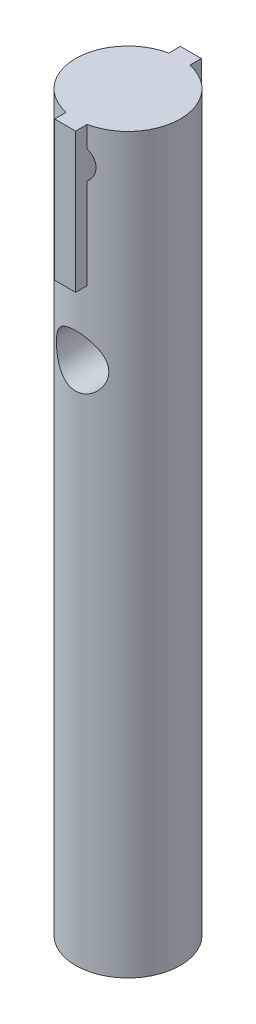
ISO-10303-21;
HEADER;
FILE_DESCRIPTION(('STEP AP214'),'2;1');
FILE_NAME('part.step','',(''),(''),'','','');
FILE_SCHEMA(('AUTOMOTIVE_DESIGN { 1 0 10303 214 1 1 1 1 }'));
ENDSEC;
DATA;
#1=APPLICATION_CONTEXT('core data for automotive mechanical design processes');
#2=APPLICATION_PROTOCOL_DEFINITION('international standard','automotive_design',2000,#1);
#3=PRODUCT_CONTEXT('',#1,'mechanical');
#4=PRODUCT('Part','Part','',(#3));
#5=PRODUCT_RELATED_PRODUCT_CATEGORY('part','',(#4));
#6=PRODUCT_DEFINITION_FORMATION('','',#4);
#7=PRODUCT_DEFINITION_CONTEXT('part definition',#1,'design');
#8=PRODUCT_DEFINITION('design','',#6,#7);
#9=PRODUCT_DEFINITION_SHAPE('','',#8);
#10=(LENGTH_UNIT() NAMED_UNIT(*) SI_UNIT(.MILLI.,.METRE.));
#11=(NAMED_UNIT(*) PLANE_ANGLE_UNIT() SI_UNIT($,.RADIAN.));
#12=(NAMED_UNIT(*) SI_UNIT($,.STERADIAN.) SOLID_ANGLE_UNIT());
#13=UNCERTAINTY_MEASURE_WITH_UNIT(LENGTH_MEASURE(1.E-05),#10,'distance_accuracy_value','');
#14=(GEOMETRIC_REPRESENTATION_CONTEXT(3) GLOBAL_UNCERTAINTY_ASSIGNED_CONTEXT((#13)) GLOBAL_UNIT_ASSIGNED_CONTEXT((#10,
#11,#12)) REPRESENTATION_CONTEXT('',''));
#15=CARTESIAN_POINT('',(0.,0.,0.));
#16=DIRECTION('',(0.,0.,1.));
#17=DIRECTION('',(1.,0.,0.));
#18=AXIS2_PLACEMENT_3D('',#15,#16,#17);
#19=CARTESIAN_POINT('',(0.,100.,10.));
#20=DIRECTION('',(0.,0.,-1.));
#21=DIRECTION('',(-1.,0.,0.));
#22=AXIS2_PLACEMENT_3D('',#19,#20,#21);
#23=CYLINDRICAL_SURFACE('',#22,2.5);
#24=DIRECTION('',(0.,0.,-1.));
#25=VECTOR('',#24,1.);
#26=CARTESIAN_POINT('',(1.5,98.,10.));
#27=LINE('',#26,#25);
#28=CARTESIAN_POINT('',(1.5,98.,7.34846922834953));
#29=VERTEX_POINT('',#28);
#30=CARTESIAN_POINT('',(1.5,98.,-7.34846922834953));
#31=VERTEX_POINT('',#30);
#32=EDGE_CURVE('E275',#29,#31,#27,.T.);
#33=ORIENTED_EDGE('',*,*,#32,.F.);
#34=CARTESIAN_POINT('',(-2.49999999999995,100.,7.07106781186549));
#35=CARTESIAN_POINT('',(-2.50000064486923,99.8638295629098,7.07106736326087));
#36=CARTESIAN_POINT('',(-2.48883695921375,99.727663000441,7.07504423227145));
#37=CARTESIAN_POINT('',(-2.44462782922197,99.4593639475144,7.09043935203139));
#38=CARTESIAN_POINT('',(-2.41157878042094,99.3272321253188,7.10185882855474));
#39=CARTESIAN_POINT('',(-2.32488871421221,99.0709327675068,7.13070509221981));
#40=CARTESIAN_POINT('',(-2.27128805350806,98.9467501763932,7.14812009928306));
#41=CARTESIAN_POINT('',(-2.1451540711034,98.7090998786301,7.18697805025813));
#42=CARTESIAN_POINT('',(-2.07261657215041,98.5956345436159,7.20842188259032));
#43=CARTESIAN_POINT('',(-1.90762786610715,98.3782000941542,7.25386223518684));
#44=CARTESIAN_POINT('',(-1.81456085344476,98.2747114283207,7.27792237111611));
#45=CARTESIAN_POINT('',(-1.61246916803594,98.0844829969384,7.32534662002508));
#46=CARTESIAN_POINT('',(-1.50344193763089,97.9977459210441,7.34871062072405));
#47=CARTESIAN_POINT('',(-1.26901126991247,97.841302756676,7.39284667304498));
#48=CARTESIAN_POINT('',(-1.14325477806126,97.7721000734551,7.41353519254015));
#49=CARTESIAN_POINT('',(-0.881078057468629,97.6560210371812,7.44923966927458));
#50=CARTESIAN_POINT('',(-0.744660714217974,97.6091386670577,7.46425715507505));
#51=CARTESIAN_POINT('',(-0.47007204358368,97.540660363419,7.48647688579767));
#52=CARTESIAN_POINT('',(-0.332126887132365,97.5182413843575,7.49393286943898));
#53=CARTESIAN_POINT('',(-0.0542446870601675,97.4967092665983,7.5010902054562));
#54=CARTESIAN_POINT('',(0.0856918338597973,97.497590120869,7.50079355657239));
#55=CARTESIAN_POINT('',(0.357758787984593,97.5221106364151,7.49265099046828));
#56=CARTESIAN_POINT('',(0.489980121479198,97.5448563211862,7.48510161887793));
#57=CARTESIAN_POINT('',(0.748608597055486,97.6109824524512,7.46367418349328));
#58=CARTESIAN_POINT('',(0.875015344448096,97.6543642974496,7.44979569077954));
#59=CARTESIAN_POINT('',(1.12038118710499,97.7610532932651,7.4168917573306));
#60=CARTESIAN_POINT('',(1.23922055242217,97.8246148463663,7.39780106310038));
#61=CARTESIAN_POINT('',(1.46481081381836,97.9696492636216,7.35645982597296));
#62=CARTESIAN_POINT('',(1.57155833596341,98.0511271083191,7.33420840503666));
#63=CARTESIAN_POINT('',(1.77525216637833,98.2341859836492,7.2876547962474));
#64=CARTESIAN_POINT('',(1.87150039266324,98.3365328946037,7.26330537922193));
#65=CARTESIAN_POINT('',(2.04569314899549,98.5561218143166,7.2161833812225));
#66=CARTESIAN_POINT('',(2.12363485820392,98.6733661143201,7.19341104364037));
#67=CARTESIAN_POINT('',(2.25996863758942,98.9216340640086,7.15176312802779));
#68=CARTESIAN_POINT('',(2.31806615905341,99.0528303282944,7.13294773211868));
#69=CARTESIAN_POINT('',(2.4111079831734,99.323928485536,7.1020412706096));
#70=CARTESIAN_POINT('',(2.4460619893688,99.4638267030156,7.08994738717729));
#71=CARTESIAN_POINT('',(2.49040320524387,99.7415958885289,7.0744909078896));
#72=CARTESIAN_POINT('',(2.50087273876914,99.8792735618717,7.07075900796888));
#73=CARTESIAN_POINT('',(2.49901359727436,100.154440372785,7.07141680147959));
#74=CARTESIAN_POINT('',(2.48668906306697,100.29192954006,7.07580501979534));
#75=CARTESIAN_POINT('',(2.44056412888084,100.55789241428,7.09184045225746));
#76=CARTESIAN_POINT('',(2.40751598495177,100.686513575377,7.10323313602099));
#77=CARTESIAN_POINT('',(2.32178465640123,100.936359015598,7.13171384177555));
#78=CARTESIAN_POINT('',(2.26909799090862,101.057581978977,7.14880287337097));
#79=CARTESIAN_POINT('',(2.14368585184741,101.293451052118,7.18742193989465));
#80=CARTESIAN_POINT('',(2.07037779589631,101.407766606604,7.20907564164069));
#81=CARTESIAN_POINT('',(1.90646407639397,101.622865130959,7.25414421827411));
#82=CARTESIAN_POINT('',(1.81585331374702,101.723644096653,7.27755961109484));
#83=CARTESIAN_POINT('',(1.61472926475088,101.913819960227,7.32487596594621));
#84=CARTESIAN_POINT('',(1.5034681763667,102.002435975047,7.3487460894474));
#85=CARTESIAN_POINT('',(1.26706822850072,102.15979035587,7.3931712903277));
#86=CARTESIAN_POINT('',(1.14192986216145,102.228529427906,7.41372648544236));
#87=CARTESIAN_POINT('',(0.881949656080811,102.343550262154,7.44911014526507));
#88=CARTESIAN_POINT('',(0.747177808303062,102.38997819287,7.46397575011327));
#89=CARTESIAN_POINT('',(0.471146164615108,102.45931935515,7.48646527094436));
#90=CARTESIAN_POINT('',(0.329888729884788,102.482241074701,7.49409180085047));
#91=CARTESIAN_POINT('',(0.0520383396501632,102.503155194014,7.50104658090641));
#92=CARTESIAN_POINT('',(-0.0844618097999865,102.502268634831,7.50074800223598));
#93=CARTESIAN_POINT('',(-0.355277862500375,102.478356729634,7.49280491298495));
#94=CARTESIAN_POINT('',(-0.489593942047582,102.455333179618,7.4851609983394));
#95=CARTESIAN_POINT('',(-0.750105298580088,102.38854441356,7.46352287386031));
#96=CARTESIAN_POINT('',(-0.876395677281915,102.345114461618,7.44963145902872));
#97=CARTESIAN_POINT('',(-1.11994587734943,102.239056172257,7.41692901761238));
#98=CARTESIAN_POINT('',(-1.23720406035602,102.176424362007,7.39811710120042));
#99=CARTESIAN_POINT('',(-1.4640850407719,102.031076219745,7.35664672069703));
#100=CARTESIAN_POINT('',(-1.57326562889396,101.947703286546,7.33387181229818));
#101=CARTESIAN_POINT('',(-1.77645256568101,101.76435652211,7.287324719797));
#102=CARTESIAN_POINT('',(-1.87045405406142,101.664377394343,7.26355221932744));
#103=CARTESIAN_POINT('',(-2.04435452208274,101.445976611033,7.21658199563997));
#104=CARTESIAN_POINT('',(-2.1235574149947,101.326986222558,7.19344319971578));
#105=CARTESIAN_POINT('',(-2.26078585825274,101.076663932743,7.1515048330754));
#106=CARTESIAN_POINT('',(-2.31881694204863,100.945335267426,7.13270412903125));
#107=CARTESIAN_POINT('',(-2.40960957051036,100.680095439961,7.10253335516288));
#108=CARTESIAN_POINT('',(-2.44339477287375,100.546569341187,7.09086582142957));
#109=CARTESIAN_POINT('',(-2.48858580037311,100.275359873833,7.07513458848798));
#110=CARTESIAN_POINT('',(-2.49999934799143,100.137677956473,7.07106826543655));
#111=CARTESIAN_POINT('',(-2.49999999999995,100.,7.07106781186549));
#112=B_SPLINE_CURVE_WITH_KNOTS('',3,(#34,#35,#36,#37,#38,#39,#40,#41,#42,#43,#44,#45,#46,#47,
#48,#49,#50,#51,#52,#53,#54,#55,#56,#57,#58,#59,#60,#61,#62,#63,#64,#65,#66,#67,#68,#69,#70,#71,
#72,#73,#74,#75,#76,#77,#78,#79,#80,#81,#82,#83,#84,#85,#86,#87,#88,#89,#90,#91,#92,#93,#94,#95,
#96,#97,#98,#99,#100,#101,#102,#103,#104,#105,#106,#107,#108,#109,#110,#111),.UNSPECIFIED.,.T.,
.F.,(4,2,2,2,2,2,2,2,2,2,2,2,2,2,2,2,2,2,2,2,2,2,2,2,2,2,2,2,2,2,2,2,2,2,2,2,2,2,4),(0.,
0.408001461998376,0.816070137537907,1.22334156875208,1.63070291546359,2.05253343568919,
2.4744316292997,2.90733765359143,3.34012690966973,3.75785796912336,4.17548133255819,
4.57672512063923,4.97799610473092,5.38454137150838,5.79119979685056,6.21700435909794,
6.64287449030267,7.07481599607639,7.5065762839154,7.91885728411102,8.33106339593085,
8.72910989421941,9.12722697867365,9.53797144339286,9.94883714155318,10.3794702042773,
10.8100879689383,11.2378447797713,11.6654470751039,12.0729521169409,12.4804241002445,
12.8814239010108,13.2824962690811,13.6983879880158,14.1144126108158,14.5467225684036,
14.9789194566717,15.3915803040673,15.8040986797616),.UNSPECIFIED.);
#113=CARTESIAN_POINT('',(1.5,102.,7.34846922834953));
#114=VERTEX_POINT('',#113);
#115=EDGE_CURVE('E256',#29,#114,#112,.T.);
#116=ORIENTED_EDGE('',*,*,#115,.T.);
#117=DIRECTION('',(0.,0.,-1.));
#118=VECTOR('',#117,1.);
#119=CARTESIAN_POINT('',(1.5,102.,10.));
#120=LINE('',#119,#118);
#121=CARTESIAN_POINT('',(1.5,102.,-7.34846922834953));
#122=VERTEX_POINT('',#121);
#123=EDGE_CURVE('E250',#122,#114,#120,.F.);
#124=ORIENTED_EDGE('',*,*,#123,.F.);
#125=CARTESIAN_POINT('',(0.,102.5,-7.5));
#126=CARTESIAN_POINT('',(0.136408407216808,102.500000634329,-7.5000003825236));
#127=CARTESIAN_POINT('',(0.272812986346375,102.488799334682,-7.49624423768862));
#128=CARTESIAN_POINT('',(0.541604402182432,102.444427227957,-7.48163025508202));
#129=CARTESIAN_POINT('',(0.673990820297047,102.411254140128,-7.47077168005381));
#130=CARTESIAN_POINT('',(0.930831973754444,102.32420189154,-7.44313269766106));
#131=CARTESIAN_POINT('',(1.05529956471509,102.270357343852,-7.42636219327133));
#132=CARTESIAN_POINT('',(1.29343734201332,102.143647067904,-7.38861114293354));
#133=CARTESIAN_POINT('',(1.40710539239677,102.070777587494,-7.36762976669445));
#134=CARTESIAN_POINT('',(1.62435418755568,101.905435487853,-7.32285236107512));
#135=CARTESIAN_POINT('',(1.72750925074579,101.812421914349,-7.29898891159462));
#136=CARTESIAN_POINT('',(1.91708173175523,101.610582113234,-7.25150786957803));
#137=CARTESIAN_POINT('',(2.00349546372368,101.501752412679,-7.22789033226372));
#138=CARTESIAN_POINT('',(2.15956235556968,101.267537212009,-7.18283331193183));
#139=CARTESIAN_POINT('',(2.22866214555262,101.14176565067,-7.16147598189219));
#140=CARTESIAN_POINT('',(2.34454718469434,100.879559763854,-7.12438263546501));
#141=CARTESIAN_POINT('',(2.39133924346695,100.743128707093,-7.10864490401863));
#142=CARTESIAN_POINT('',(2.45968365377296,100.468316946258,-7.08528258173441));
#143=CARTESIAN_POINT('',(2.48203362067947,100.330156978777,-7.07740239424026));
#144=CARTESIAN_POINT('',(2.50335280833625,100.05184061461,-7.06989141573767));
#145=CARTESIAN_POINT('',(2.50232925401186,99.9116848482271,-7.07025807556823));
#146=CARTESIAN_POINT('',(2.47754975925862,99.64015842389,-7.07897537520448));
#147=CARTESIAN_POINT('',(2.45483478291756,99.5086789927025,-7.0869603966883));
#148=CARTESIAN_POINT('',(2.38901540712362,99.251516450983,-7.10941644311375));
#149=CARTESIAN_POINT('',(2.34590856647976,99.1258340364124,-7.12388824460266));
#150=CARTESIAN_POINT('',(2.23984764515062,98.8814681260214,-7.15794777828119));
#151=CARTESIAN_POINT('',(2.17658512176825,98.7629299363262,-7.1776141448279));
#152=CARTESIAN_POINT('',(2.03222276575795,98.5378227293007,-7.21981396439313));
#153=CARTESIAN_POINT('',(1.95111778091011,98.4312571826666,-7.24234824476156));
#154=CARTESIAN_POINT('',(1.7683733317057,98.2272710045981,-7.2891832291935));
#155=CARTESIAN_POINT('',(1.66588287519089,98.1306182637274,-7.31351473387105));
#156=CARTESIAN_POINT('',(1.44584892492527,97.9556718333415,-7.3601734596759));
#157=CARTESIAN_POINT('',(1.32830398915215,97.8773799045888,-7.38250048845166));
#158=CARTESIAN_POINT('',(1.07986903261578,97.7407592494124,-7.42292769844482));
#159=CARTESIAN_POINT('',(0.948858191040957,97.6826362716482,-7.44098375020097));
#160=CARTESIAN_POINT('',(0.678172708411392,97.5894920651107,-7.47051417861086));
#161=CARTESIAN_POINT('',(0.538501095387512,97.5544628114414,-7.48199084137197));
#162=CARTESIAN_POINT('',(0.260959573823391,97.5098608349441,-7.49669067678601));
#163=CARTESIAN_POINT('',(0.123273999662244,97.4992504770681,-7.5002500458432));
#164=CARTESIAN_POINT('',(-0.15193767490047,97.5008316839962,-7.49972256737069));
#165=CARTESIAN_POINT('',(-0.289463798299006,97.5130193999497,-7.49563701048406));
#166=CARTESIAN_POINT('',(-0.556299665760522,97.5590297693399,-7.48050061792762));
#167=CARTESIAN_POINT('',(-0.685732017086993,97.5922155151237,-7.46965496777982));
#168=CARTESIAN_POINT('',(-0.93713989644882,97.6784836111668,-7.44229617075176));
#169=CARTESIAN_POINT('',(-1.0591144712714,97.7315684986694,-7.42578230116689));
#170=CARTESIAN_POINT('',(-1.29572074098308,97.8576760796019,-7.38822328218226));
#171=CARTESIAN_POINT('',(-1.41007489804276,97.9311864832079,-7.36707036889467));
#172=CARTESIAN_POINT('',(-1.62516207533887,98.0954853750337,-7.32263134790658));
#173=CARTESIAN_POINT('',(-1.72589091948884,98.1862791400794,-7.29934458984571));
#174=CARTESIAN_POINT('',(-1.91563126951566,98.3874468775164,-7.25192119951114));
#175=CARTESIAN_POINT('',(-2.00390242311434,98.4985230673171,-7.22779402718572));
#176=CARTESIAN_POINT('',(-2.16064380580885,98.7344289195272,-7.18249933236774));
#177=CARTESIAN_POINT('',(-2.22911386982745,98.8592586965851,-7.16133183455008));
#178=CARTESIAN_POINT('',(-2.34399232604083,99.1191825382247,-7.12455979478461));
#179=CARTESIAN_POINT('',(-2.39044533041248,99.2542551979219,-7.10894401982449));
#180=CARTESIAN_POINT('',(-2.45973666689832,99.5309466251103,-7.08527080766126));
#181=CARTESIAN_POINT('',(-2.48258563738479,99.6725624135108,-7.077209965591));
#182=CARTESIAN_POINT('',(-2.5031907061933,99.9504927401022,-7.06994647185445));
#183=CARTESIAN_POINT('',(-2.50217564327095,100.086705850717,-7.07031000643539));
#184=CARTESIAN_POINT('',(-2.47810573362168,100.356912687305,-7.0787817455967));
#185=CARTESIAN_POINT('',(-2.45505219864642,100.490906544888,-7.08688948923406));
#186=CARTESIAN_POINT('',(-2.38842953282333,100.750339157506,-7.1096131076223));
#187=CARTESIAN_POINT('',(-2.34525836503875,100.875892062511,-7.12410245056195));
#188=CARTESIAN_POINT('',(-2.23994841439934,101.118068517346,-7.15790997046172));
#189=CARTESIAN_POINT('',(-2.17780542138449,101.23469007797,-7.17722921908484));
#190=CARTESIAN_POINT('',(-2.03315173145856,101.461209174807,-7.21957073065116));
#191=CARTESIAN_POINT('',(-1.94987060691144,101.570591254746,-7.24271779105343));
#192=CARTESIAN_POINT('',(-1.76660720783911,101.77422453346,-7.28958390708132));
#193=CARTESIAN_POINT('',(-1.66662021112869,101.86847143922,-7.31330312280931));
#194=CARTESIAN_POINT('',(-1.44810389230171,102.042861030723,-7.3597507631386));
#195=CARTESIAN_POINT('',(-1.32900378374932,102.122310869377,-7.38240454503142));
#196=CARTESIAN_POINT('',(-1.07839339351657,102.259976072127,-7.4231497793153));
#197=CARTESIAN_POINT('',(-0.94688629533088,102.318196864805,-7.44124239769824));
#198=CARTESIAN_POINT('',(-0.681234118002449,102.409304081222,-7.47013787671354));
#199=CARTESIAN_POINT('',(-0.54746939419103,102.443206165658,-7.48123031056307));
#200=CARTESIAN_POINT('',(-0.275801040025623,102.488550701693,-7.49616017660554));
#201=CARTESIAN_POINT('',(-0.137898563921868,102.499999358741,-7.49999961329762));
#202=CARTESIAN_POINT('',(0.,102.5,-7.5));
#203=B_SPLINE_CURVE_WITH_KNOTS('',3,(#125,#126,#127,#128,#129,#130,#131,#132,#133,#134,#135,
#136,#137,#138,#139,#140,#141,#142,#143,#144,#145,#146,#147,#148,#149,#150,#151,#152,#153,#154,
#155,#156,#157,#158,#159,#160,#161,#162,#163,#164,#165,#166,#167,#168,#169,#170,#171,#172,#173,
#174,#175,#176,#177,#178,#179,#180,#181,#182,#183,#184,#185,#186,#187,#188,#189,#190,#191,#192,
#193,#194,#195,#196,#197,#198,#199,#200,#201,#202),.UNSPECIFIED.,.T.,.F.,(4,2,2,2,2,2,2,2,2,2,2,
2,2,2,2,2,2,2,2,2,2,2,2,2,2,2,2,2,2,2,2,2,2,2,2,2,2,2,4),(0.,0.408717765065029,
0.817477963168799,1.22555668217568,1.63371594449775,2.0546171070689,2.47561083218825,
2.90870962058678,3.34167611732082,3.76004814354599,4.17829084968714,4.57742066378201,
4.97659827138706,5.38220427887826,5.78792756395517,6.21483264528418,6.64177864916546,
7.07296014125894,7.5039917219302,7.91633957937924,8.32861782910443,8.72895394945535,
9.12934113210261,9.54025999609343,9.95130452054729,10.3810255720188,10.8107502058749,
11.2396003456693,11.668257117646,12.0748916516065,12.4815019837844,12.8803896770105,
13.2793659543995,13.6957516672951,14.1122552780945,14.5449915208775,14.9776170288114,
15.3909139593454,15.8040966509535),.UNSPECIFIED.);
#204=EDGE_CURVE('E196',#122,#31,#203,.T.);
#205=ORIENTED_EDGE('',*,*,#204,.T.);
#206=EDGE_LOOP('',(#33,#116,#124,#205));
#207=FACE_BOUND('',#206,.T.);
#208=ADVANCED_FACE('F38',(#207),#23,.F.);
#209=CARTESIAN_POINT('',(0.,105.,0.));
#210=DIRECTION('',(0.,-1.,0.));
#211=DIRECTION('',(0.,0.,-1.));
#212=AXIS2_PLACEMENT_3D('',#209,#210,#211);
#213=CYLINDRICAL_SURFACE('',#212,7.5);
#214=CARTESIAN_POINT('',(0.,105.,0.));
#215=DIRECTION('',(0.,1.,0.));
#216=DIRECTION('',(0.,0.,1.));
#217=AXIS2_PLACEMENT_3D('',#214,#215,#216);
#218=CIRCLE('',#217,7.5);
#219=CARTESIAN_POINT('',(1.5,105.,7.34846922834953));
#220=VERTEX_POINT('',#219);
#221=CARTESIAN_POINT('',(1.5,105.,-7.34846922834953));
#222=VERTEX_POINT('',#221);
#223=EDGE_CURVE('E188',#220,#222,#218,.T.);
#224=ORIENTED_EDGE('',*,*,#223,.F.);
#225=DIRECTION('',(0.,-1.,0.));
#226=VECTOR('',#225,1.);
#227=CARTESIAN_POINT('',(1.5,105.,7.34846922834953));
#228=LINE('',#227,#226);
#229=EDGE_CURVE('E186',#220,#114,#228,.T.);
#230=ORIENTED_EDGE('',*,*,#229,.T.);
#231=ORIENTED_EDGE('',*,*,#115,.F.);
#232=CARTESIAN_POINT('',(1.5,85.,7.34846922834953));
#233=VERTEX_POINT('',#232);
#234=EDGE_CURVE('E57',#29,#233,#228,.T.);
#235=ORIENTED_EDGE('',*,*,#234,.T.);
#236=CARTESIAN_POINT('',(0.,85.,0.));
#237=DIRECTION('',(0.,-1.,0.));
#238=DIRECTION('',(0.,0.,-1.));
#239=AXIS2_PLACEMENT_3D('',#236,#237,#238);
#240=CIRCLE('',#239,7.5);
#241=CARTESIAN_POINT('',(-1.5,85.,7.34846922834953));
#242=VERTEX_POINT('',#241);
#243=EDGE_CURVE('E11',#233,#242,#240,.T.);
#244=ORIENTED_EDGE('',*,*,#243,.T.);
#245=DIRECTION('',(0.,-1.,0.));
#246=VECTOR('',#245,1.);
#247=CARTESIAN_POINT('',(-1.5,105.,7.34846922834953));
#248=LINE('',#247,#246);
#249=CARTESIAN_POINT('',(-1.5,98.,7.34846922834953));
#250=VERTEX_POINT('',#249);
#251=EDGE_CURVE('E174',#242,#250,#248,.F.);
#252=ORIENTED_EDGE('',*,*,#251,.T.);
#253=CARTESIAN_POINT('',(-1.50000000000005,102.,7.34846922834954));
#254=VERTEX_POINT('',#253);
#255=EDGE_CURVE('E243',#254,#250,#112,.T.);
#256=ORIENTED_EDGE('',*,*,#255,.F.);
#257=CARTESIAN_POINT('',(-1.5,105.,7.34846922834953));
#258=VERTEX_POINT('',#257);
#259=EDGE_CURVE('E181',#254,#258,#248,.F.);
#260=ORIENTED_EDGE('',*,*,#259,.T.);
#261=CARTESIAN_POINT('',(-1.5,105.,-7.34846922834953));
#262=VERTEX_POINT('',#261);
#263=EDGE_CURVE('E192',#262,#258,#218,.T.);
#264=ORIENTED_EDGE('',*,*,#263,.F.);
#265=DIRECTION('',(0.,-1.,0.));
#266=VECTOR('',#265,1.);
#267=CARTESIAN_POINT('',(-1.5,105.,-7.34846922834953));
#268=LINE('',#267,#266);
#269=CARTESIAN_POINT('',(-1.5,102.,-7.34846922834953));
#270=VERTEX_POINT('',#269);
#271=EDGE_CURVE('E183',#262,#270,#268,.T.);
#272=ORIENTED_EDGE('',*,*,#271,.T.);
#273=CARTESIAN_POINT('',(-1.5,98.,-7.34846922834953));
#274=VERTEX_POINT('',#273);
#275=EDGE_CURVE('E245',#274,#270,#203,.T.);
#276=ORIENTED_EDGE('',*,*,#275,.F.);
#277=CARTESIAN_POINT('',(-1.5,85.,-7.34846922834953));
#278=VERTEX_POINT('',#277);
#279=EDGE_CURVE('E180',#274,#278,#268,.T.);
#280=ORIENTED_EDGE('',*,*,#279,.T.);
#281=CARTESIAN_POINT('',(1.5,85.,-7.34846922834953));
#282=VERTEX_POINT('',#281);
#283=EDGE_CURVE('E43',#278,#282,#240,.T.);
#284=ORIENTED_EDGE('',*,*,#283,.T.);
#285=DIRECTION('',(0.,-1.,0.));
#286=VECTOR('',#285,1.);
#287=CARTESIAN_POINT('',(1.5,105.,-7.34846922834953));
#288=LINE('',#287,#286);
#289=EDGE_CURVE('E134',#282,#31,#288,.F.);
#290=ORIENTED_EDGE('',*,*,#289,.T.);
#291=ORIENTED_EDGE('',*,*,#204,.F.);
#292=EDGE_CURVE('E184',#122,#222,#288,.F.);
#293=ORIENTED_EDGE('',*,*,#292,.T.);
#294=EDGE_LOOP('',(#224,#230,#231,#235,#244,#252,#256,#260,#264,#272,#276,#280,#284,#290,#291,#293));
#295=FACE_BOUND('',#294,.T.);
#296=CARTESIAN_POINT('',(0.,78.75,-7.5));
#297=CARTESIAN_POINT('',(-0.0986167654392083,78.7499996204552,-7.49999966655176));
#298=CARTESIAN_POINT('',(-0.197240620657901,78.7461051962669,-7.49805025894361));
#299=CARTESIAN_POINT('',(-0.393760546595002,78.730573051782,-7.49030247329046));
#300=CARTESIAN_POINT('',(-0.491656281961516,78.7189319629036,-7.48450242082259));
#301=CARTESIAN_POINT('',(-0.686088879722453,78.6880185799732,-7.46918997805877));
#302=CARTESIAN_POINT('',(-0.782623600042447,78.6687354031341,-7.45967229391405));
#303=CARTESIAN_POINT('',(-0.973514254870795,78.6227651179159,-7.43717233353405));
#304=CARTESIAN_POINT('',(-1.06786928155669,78.5960749827524,-7.42418864102967));
#305=CARTESIAN_POINT('',(-1.34589164426382,78.505548533327,-7.38061850898881));
#306=CARTESIAN_POINT('',(-1.52549644367333,78.4310972054552,-7.34533102942187));
#307=CARTESIAN_POINT('',(-1.86930137808191,78.2566040239808,-7.26546455923924));
#308=CARTESIAN_POINT('',(-2.03350272627851,78.1565641880819,-7.22088630127083));
#309=CARTESIAN_POINT('',(-2.35314676181656,77.9268095413113,-7.12335990736739));
#310=CARTESIAN_POINT('',(-2.50745859662554,77.7956656048112,-7.07006856808264));
#311=CARTESIAN_POINT('',(-2.79292136215461,77.51055455852,-6.96225028451373));
#312=CARTESIAN_POINT('',(-2.9240546436535,77.3565702196716,-6.9077224340335));
#313=CARTESIAN_POINT('',(-3.16970986433261,77.0156446995391,-6.7987043918843));
#314=CARTESIAN_POINT('',(-3.28215495728601,76.8270737771395,-6.74454505145703));
#315=CARTESIAN_POINT('',(-3.42542549238493,76.5300614183151,-6.6722806085229));
#316=CARTESIAN_POINT('',(-3.46895988796167,76.4286613550569,-6.64968211169738));
#317=CARTESIAN_POINT('',(-3.54711621920495,76.2217491951639,-6.60832211451658));
#318=CARTESIAN_POINT('',(-3.58174342288326,76.1162395717776,-6.58955834752943));
#319=CARTESIAN_POINT('',(-3.63985355818266,75.908255419361,-6.55762921861306));
#320=CARTESIAN_POINT('',(-3.66387570824429,75.8059721069994,-6.54419779187991));
#321=CARTESIAN_POINT('',(-3.70329431318467,75.599305759819,-6.52197249176822));
#322=CARTESIAN_POINT('',(-3.71869534452899,75.4949238695617,-6.51317615802608));
#323=CARTESIAN_POINT('',(-3.74064294197008,75.2849942874027,-6.50059625146363));
#324=CARTESIAN_POINT('',(-3.74719484062154,75.1794473362745,-6.4968096597628));
#325=CARTESIAN_POINT('',(-3.75135318803881,74.9681245517313,-6.49440958516441));
#326=CARTESIAN_POINT('',(-3.74896049027841,74.8623487411161,-6.49579560870723));
#327=CARTESIAN_POINT('',(-3.73609293933285,74.6642216224747,-6.50320345921186));
#328=CARTESIAN_POINT('',(-3.72662198691743,74.5717819757217,-6.50864926791523));
#329=CARTESIAN_POINT('',(-3.70091050001044,74.3881405444314,-6.52330228027124));
#330=CARTESIAN_POINT('',(-3.68466773329616,74.2969391783193,-6.53251072419779));
#331=CARTESIAN_POINT('',(-3.62603670781943,74.0261445617802,-6.5653578300761));
#332=CARTESIAN_POINT('',(-3.57373645335304,73.8492230086893,-6.5942240975762));
#333=CARTESIAN_POINT('',(-3.44328374601237,73.5028628133314,-6.66328047661971));
#334=CARTESIAN_POINT('',(-3.36455749572013,73.3336944606624,-6.70371869198214));
#335=CARTESIAN_POINT('',(-3.18390533427269,73.0101279496222,-6.7913779936202));
#336=CARTESIAN_POINT('',(-3.08196900240039,72.8557364700379,-6.83860212306902));
#337=CARTESIAN_POINT('',(-2.84275549422678,72.5455472982907,-6.94174179449038));
#338=CARTESIAN_POINT('',(-2.70263608450086,72.3920535269224,-6.9980001366654));
#339=CARTESIAN_POINT('',(-2.39830153948002,72.1097253694445,-7.1080423740738));
#340=CARTESIAN_POINT('',(-2.23407495429831,71.9809027684743,-7.16182507745035));
#341=CARTESIAN_POINT('',(-1.96822812942694,71.8061681791656,-7.23775919355942));
#342=CARTESIAN_POINT('',(-1.8740298124975,71.7499842497027,-7.26277857061455));
#343=CARTESIAN_POINT('',(-1.68053014742527,71.6458425616726,-7.30997352054392));
#344=CARTESIAN_POINT('',(-1.58123112092062,71.5978811029369,-7.33215037143468));
#345=CARTESIAN_POINT('',(-1.37819789090772,71.5106908934707,-7.37301130540841));
#346=CARTESIAN_POINT('',(-1.27446440663094,71.4714607329554,-7.3916959522762));
#347=CARTESIAN_POINT('',(-1.06338495903207,71.402217610485,-7.42499937274764));
#348=CARTESIAN_POINT('',(-0.956041090154764,71.3721994034682,-7.43962045959411));
#349=CARTESIAN_POINT('',(-0.74757878043325,71.3238452592925,-7.46332421704559));
#350=CARTESIAN_POINT('',(-0.646676535290034,71.3047503246358,-7.47276407001017));
#351=CARTESIAN_POINT('',(-0.443395755700503,71.274889683777,-7.48757491029244));
#352=CARTESIAN_POINT('',(-0.341017959130066,71.2641199522067,-7.49294786399439));
#353=CARTESIAN_POINT('',(-0.135607931026715,71.2510401856714,-7.49947781577039));
#354=CARTESIAN_POINT('',(-0.0325758242750137,71.2487285835045,-7.50063559487144));
#355=CARTESIAN_POINT('',(0.173285289627701,71.2525914762434,-7.49870441882014));
#356=CARTESIAN_POINT('',(0.276114305565378,71.2587655955892,-7.49561565161087));
#357=CARTESIAN_POINT('',(0.472743432158179,71.2787096013648,-7.4856818875756));
#358=CARTESIAN_POINT('',(0.566623461210725,71.2918510154084,-7.47914789587353));
#359=CARTESIAN_POINT('',(0.752845975744951,71.3251278946563,-7.46270608610675));
#360=CARTESIAN_POINT('',(0.845187929575482,71.3452657277418,-7.45279712583369));
#361=CARTESIAN_POINT('',(1.1189225409835,71.4158767252706,-7.41833557409843));
#362=CARTESIAN_POINT('',(1.29720101869745,71.4765657568094,-7.38903874813701));
#363=CARTESIAN_POINT('',(1.64586087927541,71.6249982270932,-7.31940838851756));
#364=CARTESIAN_POINT('',(1.81587071738369,71.7134656023471,-7.27878323943982));
#365=CARTESIAN_POINT('',(2.13922337488943,71.91415409462,-7.19039886375065));
#366=CARTESIAN_POINT('',(2.2925590519849,72.0263853305925,-7.14263660062315));
#367=CARTESIAN_POINT('',(2.59412697851802,72.2840935497215,-7.0390602034411));
#368=CARTESIAN_POINT('',(2.74037938350264,72.4317530036803,-6.98291595995282));
#369=CARTESIAN_POINT('',(3.00697712274516,72.7497520924264,-6.87233189865228));
#370=CARTESIAN_POINT('',(3.12730453514355,72.9201072858779,-6.81789328200996));
#371=CARTESIAN_POINT('',(3.28849622468462,73.194369388518,-6.74088903832053));
#372=CARTESIAN_POINT('',(3.3399523001172,73.2913910235284,-6.71546891301382));
#373=CARTESIAN_POINT('',(3.43438702644389,73.4901735331033,-6.66766699353988));
#374=CARTESIAN_POINT('',(3.47736976367013,73.5919320938362,-6.64528373645144));
#375=CARTESIAN_POINT('',(3.554355009018,73.799457792529,-6.60442745722267));
#376=CARTESIAN_POINT('',(3.58836472575753,73.9052216341831,-6.58595129863636));
#377=CARTESIAN_POINT('',(3.64698754255715,74.1200182397545,-6.5536711295624));
#378=CARTESIAN_POINT('',(3.67160209753724,74.2290504947077,-6.53986639570285));
#379=CARTESIAN_POINT('',(3.70915371015542,74.4388238748399,-6.51863461518746));
#380=CARTESIAN_POINT('',(3.72298479555475,74.5393564058506,-6.51072262305063));
#381=CARTESIAN_POINT('',(3.74245423422249,74.7414634408121,-6.4995510137786));
#382=CARTESIAN_POINT('',(3.74809344586398,74.8430378344695,-6.49629090920305));
#383=CARTESIAN_POINT('',(3.75109039049422,75.0463195281847,-6.49456132559811));
#384=CARTESIAN_POINT('',(3.74845103441269,75.1480267689593,-6.4960901626694));
#385=CARTESIAN_POINT('',(3.73494987946859,75.3506823254189,-6.50386025139356));
#386=CARTESIAN_POINT('',(3.72408841721535,75.4516306720019,-6.51010131013017));
#387=CARTESIAN_POINT('',(3.68222108531605,75.7329376284762,-6.53393324608931));
#388=CARTESIAN_POINT('',(3.64203079689416,75.9115930006067,-6.55661962633487));
#389=CARTESIAN_POINT('',(3.53690797535669,76.2593142211437,-6.61390952264854));
#390=CARTESIAN_POINT('',(3.47196748328332,76.4283769647224,-6.6485168718147));
#391=CARTESIAN_POINT('',(3.31430942753394,76.7648330189194,-6.72857086199423));
#392=CARTESIAN_POINT('',(3.2200187839252,76.9313510397766,-6.77458953172496));
#393=CARTESIAN_POINT('',(3.00806412547228,77.2472831046347,-6.87132499445962));
#394=CARTESIAN_POINT('',(2.89038795043561,77.3966881861319,-6.92204422434477));
#395=CARTESIAN_POINT('',(2.61827110130054,77.6930277272236,-7.02983576475789));
#396=CARTESIAN_POINT('',(2.46110064942282,77.8374561840223,-7.08693120350122));
#397=CARTESIAN_POINT('',(2.12304644133412,78.0985016463871,-7.19542138058945));
#398=CARTESIAN_POINT('',(1.9421499842865,78.2151036611644,-7.2468130382287));
#399=CARTESIAN_POINT('',(1.65565412585482,78.3664727338267,-7.31564259860024));
#400=CARTESIAN_POINT('',(1.55719134725464,78.413150288821,-7.33728157433504));
#401=CARTESIAN_POINT('',(1.35599647152886,78.4979521378139,-7.37711058977606));
#402=CARTESIAN_POINT('',(1.25326650133999,78.5360806337794,-7.39530232316007));
#403=CARTESIAN_POINT('',(1.04452125821338,78.6032590729069,-7.42765863061586));
#404=CARTESIAN_POINT('',(0.938513715432039,78.6323288169251,-7.44183198196344));
#405=CARTESIAN_POINT('',(0.723927906516418,78.6811032000155,-7.46575963672149));
#406=CARTESIAN_POINT('',(0.615351253410581,78.7008135597866,-7.475516639348));
#407=CARTESIAN_POINT('',(0.422281234015602,78.7271058948738,-7.48857290666057));
#408=CARTESIAN_POINT('',(0.338119334594828,78.7356838023525,-7.49285055395041));
#409=CARTESIAN_POINT('',(0.169306707241022,78.7471310966045,-7.49856428295742));
#410=CARTESIAN_POINT('',(0.0846559658802822,78.7500003258141,-7.50000028624324));
#411=CARTESIAN_POINT('',(0.,78.75,-7.5));
#412=B_SPLINE_CURVE_WITH_KNOTS('',3,(#296,#297,#298,#299,#300,#301,#302,#303,#304,#305,#306,
#307,#308,#309,#310,#311,#312,#313,#314,#315,#316,#317,#318,#319,#320,#321,#322,#323,#324,#325,
#326,#327,#328,#329,#330,#331,#332,#333,#334,#335,#336,#337,#338,#339,#340,#341,#342,#343,#344,
#345,#346,#347,#348,#349,#350,#351,#352,#353,#354,#355,#356,#357,#358,#359,#360,#361,#362,#363,
#364,#365,#366,#367,#368,#369,#370,#371,#372,#373,#374,#375,#376,#377,#378,#379,#380,#381,#382,
#383,#384,#385,#386,#387,#388,#389,#390,#391,#392,#393,#394,#395,#396,#397,#398,#399,#400,#401,
#402,#403,#404,#405,#406,#407,#408,#409,#410,#411),.UNSPECIFIED.,.T.,.F.,(4,2,2,2,2,2,2,2,2,2,2,
2,2,2,2,2,2,2,2,2,2,2,2,2,2,2,2,2,2,2,2,2,2,2,2,2,2,2,2,2,2,2,2,2,2,2,2,2,2,2,2,2,2,2,2,2,2,4),
(0.,0.295766470987418,0.591661638028362,0.88797970026779,1.1844190288627,1.77434655054933,
2.36422756963409,2.98979506264604,3.61583685865584,4.29042820860645,4.62795178823152,
4.96527528372482,5.28258929661396,5.59973470526774,5.91668891428826,6.23361288100507,
6.51252108254595,6.79152129459708,7.34911222651568,7.91969108562101,8.49052662656104,
9.13374237932319,9.77726462675349,10.1143828399611,10.4513489471578,10.7882606071392,
11.1249800803913,11.4339441249333,11.7427586868429,12.0515160257885,12.3602597002343,
12.644977677334,12.9297921089406,13.4988926761209,14.0842652160072,14.6698875180237,
15.3130185141165,15.9565926880302,16.2943894083677,16.6320228229753,16.9693841627807,
17.3066932381226,17.611628611251,17.9165320298832,18.2213282496694,18.5261119919101,
19.0770196313167,19.6281045765478,20.2162143762454,20.8046307898708,21.4645438503642,
22.1248116237435,22.457709989705,22.7904443716112,23.1224462680549,23.4542449742649,
23.7081339059937,23.9620298451368),.UNSPECIFIED.);
#413=CARTESIAN_POINT('',(0.,78.75,-7.5));
#414=VERTEX_POINT('',#413);
#415=EDGE_CURVE('E203',#414,#414,#412,.T.);
#416=ORIENTED_EDGE('',*,*,#415,.T.);
#417=EDGE_LOOP('',(#416));
#418=FACE_BOUND('',#417,.T.);
#419=CARTESIAN_POINT('',(3.75000000000001,75.,6.49519052838328));
#420=CARTESIAN_POINT('',(3.74999953328281,74.9022512574061,6.4951911212148));
#421=CARTESIAN_POINT('',(3.74617277998938,74.804493818739,6.49740479490479));
#422=CARTESIAN_POINT('',(3.73091692606014,74.6097335863112,6.50617661684849));
#423=CARTESIAN_POINT('',(3.71948428613981,74.5127311651566,6.5127367876732));
#424=CARTESIAN_POINT('',(3.68914254653758,74.3201148322785,6.52997184417383));
#425=CARTESIAN_POINT('',(3.67022172087296,74.2245033432849,6.54065318265247));
#426=CARTESIAN_POINT('',(3.62514434035602,74.0354868734265,6.56574350107033));
#427=CARTESIAN_POINT('',(3.5989846412263,73.9420828705849,6.58015410067491));
#428=CARTESIAN_POINT('',(3.51040099609315,73.6671665943664,6.62809257924152));
#429=CARTESIAN_POINT('',(3.43767108423081,73.4897007594216,6.66644910734366));
#430=CARTESIAN_POINT('',(3.26724445668851,73.1496285339365,6.75160244955064));
#431=CARTESIAN_POINT('',(3.16954639033667,72.9870229479192,6.79839972022374));
#432=CARTESIAN_POINT('',(2.94250912023886,72.6663670365489,6.89988024622571));
#433=CARTESIAN_POINT('',(2.8112248223079,72.5097985627059,6.95489557771766));
#434=CARTESIAN_POINT('',(2.52467207702724,72.2196982118907,7.06395616655438));
#435=CARTESIAN_POINT('',(2.36939173883305,72.0861778258444,7.11800092804766));
#436=CARTESIAN_POINT('',(2.11524785446727,71.9015793126639,7.19613368962563));
#437=CARTESIAN_POINT('',(2.02378397275717,71.841063504716,7.22245236788426));
#438=CARTESIAN_POINT('',(1.83541337870272,71.7280270872665,7.27260181684671));
#439=CARTESIAN_POINT('',(1.73850900225947,71.6755030818475,7.29643364291624));
#440=CARTESIAN_POINT('',(1.53985772678928,71.5789567919539,7.34092648782545));
#441=CARTESIAN_POINT('',(1.43811090560437,71.5349343708744,7.36158755761232));
#442=CARTESIAN_POINT('',(1.23054930522121,71.4559107094598,7.39911204265731));
#443=CARTESIAN_POINT('',(1.12473684949786,71.420904402086,7.41597759031591));
#444=CARTESIAN_POINT('',(0.917458664679421,71.3624828491054,7.44435537741988));
#445=CARTESIAN_POINT('',(0.816214704547905,71.338422981503,7.45616184381773));
#446=CARTESIAN_POINT('',(0.61174133290779,71.2987690242857,7.47571484869696));
#447=CARTESIAN_POINT('',(0.508512918549626,71.2831707923355,7.48346337365117));
#448=CARTESIAN_POINT('',(0.300912679831368,71.2606351246834,7.49468171205998));
#449=CARTESIAN_POINT('',(0.196541191915296,71.2536952061823,7.49815275209364));
#450=CARTESIAN_POINT('',(-0.0124660733361907,71.2485640440495,7.5007177504055));
#451=CARTESIAN_POINT('',(-0.117101834110504,71.2503722651615,7.49981197647973));
#452=CARTESIAN_POINT('',(-0.316619239654764,71.2621735889512,7.49391902644308));
#453=CARTESIAN_POINT('',(-0.411555214585686,71.2714386254535,7.48929493274966));
#454=CARTESIAN_POINT('',(-0.600226575602579,71.2971215665976,7.47654275259205));
#455=CARTESIAN_POINT('',(-0.693961545247555,71.3135418866982,7.46841348287099));
#456=CARTESIAN_POINT('',(-0.972320047683613,71.3732911151913,7.43903620774193));
#457=CARTESIAN_POINT('',(-1.15428690043049,71.4271199035145,7.41279258815891));
#458=CARTESIAN_POINT('',(-1.50868942056887,71.5615631004406,7.34893380486079));
#459=CARTESIAN_POINT('',(-1.6809583879172,71.6425377958625,7.31116633442971));
#460=CARTESIAN_POINT('',(-2.00990495305432,71.8284861887071,7.22766194749592));
#461=CARTESIAN_POINT('',(-2.16657694001105,71.9334684781245,7.18192217921233));
#462=CARTESIAN_POINT('',(-2.47565450443527,72.1758608619656,7.08166443610307));
#463=CARTESIAN_POINT('',(-2.62625685802357,72.3153982105845,7.02672538470508));
#464=CARTESIAN_POINT('',(-2.90288730883137,72.6171996050484,6.91703898816252));
#465=CARTESIAN_POINT('',(-3.0288964991001,72.779480972862,6.86229182204187));
#466=CARTESIAN_POINT('',(-3.2606588775751,73.1349776999223,6.75540105485286));
#467=CARTESIAN_POINT('',(-3.36461756936828,73.3295030483611,6.70364357125201));
#468=CARTESIAN_POINT('',(-3.494285452366,73.6344538167726,6.63643993033366));
#469=CARTESIAN_POINT('',(-3.53313496260686,73.738320388327,6.61577433110625));
#470=CARTESIAN_POINT('',(-3.60164122386987,73.9497607551815,6.57873091807786));
#471=CARTESIAN_POINT('',(-3.63130364366233,74.0573322187069,6.56235046116103));
#472=CARTESIAN_POINT('',(-3.67904909880129,74.2667145250829,6.5356931998653));
#473=CARTESIAN_POINT('',(-3.69786013382377,74.3683117817989,6.52503727825126));
#474=CARTESIAN_POINT('',(-3.72704878999597,74.5730440484272,6.50840921451749));
#475=CARTESIAN_POINT('',(-3.73743079686216,74.6761782301759,6.50243463669945));
#476=CARTESIAN_POINT('',(-3.74960829865518,74.8830887579744,6.49542078560213));
#477=CARTESIAN_POINT('',(-3.75140699087484,74.9868648504859,6.49437967460281));
#478=CARTESIAN_POINT('',(-3.74640927767189,75.1941080778994,6.49726191572437));
#479=CARTESIAN_POINT('',(-3.73961345241365,75.2975752331832,6.50118493274674));
#480=CARTESIAN_POINT('',(-3.70887671737917,75.5835739071626,6.51880615781322));
#481=CARTESIAN_POINT('',(-3.67570217596294,75.7648884473286,6.53773948378731));
#482=CARTESIAN_POINT('',(-3.58386320477274,76.1189137040177,6.58852085428305));
#483=CARTESIAN_POINT('',(-3.52519052019405,76.2916216140178,6.62037308096479));
#484=CARTESIAN_POINT('',(-3.38117835226484,76.6327823691268,6.69510965599548));
#485=CARTESIAN_POINT('',(-3.29472964908168,76.8006676643636,6.73843663326228));
#486=CARTESIAN_POINT('',(-3.09857457884213,77.1205134189865,6.83085446949345));
#487=CARTESIAN_POINT('',(-2.98885626429833,77.2724656376137,6.87994828356812));
#488=CARTESIAN_POINT('',(-2.73314810611396,77.5761653397496,6.9857984976656));
#489=CARTESIAN_POINT('',(-2.58432946492748,77.7254725201958,7.04274071156217));
#490=CARTESIAN_POINT('',(-2.26273215230042,77.9978126931338,7.15253997047034));
#491=CARTESIAN_POINT('',(-2.08994541978863,78.1208368104624,7.20539563171827));
#492=CARTESIAN_POINT('',(-1.81330524576242,78.2842572148163,7.27814572487862));
#493=CARTESIAN_POINT('',(-1.71677761099083,78.3357469059747,7.30157207003268));
#494=CARTESIAN_POINT('',(-1.51901744676027,78.4303177079298,7.3452579749171));
#495=CARTESIAN_POINT('',(-1.41778705876853,78.4734026003938,7.36551895805413));
#496=CARTESIAN_POINT('',(-1.21137564620035,78.5506634212782,7.40226704722017));
#497=CARTESIAN_POINT('',(-1.10619651964307,78.5848435687259,7.41875593999525));
#498=CARTESIAN_POINT('',(-0.892685466598403,78.6438818242022,7.44746317606939));
#499=CARTESIAN_POINT('',(-0.784353915617416,78.6687410376513,7.45968202576452));
#500=CARTESIAN_POINT('',(-0.575571327628311,78.7069424938756,7.4785476105054));
#501=CARTESIAN_POINT('',(-0.475311860013027,78.721133692738,7.48560346552302));
#502=CARTESIAN_POINT('',(-0.273735239129521,78.7413677943198,7.49568247541691));
#503=CARTESIAN_POINT('',(-0.172417744935138,78.7474079834453,7.49870428729588));
#504=CARTESIAN_POINT('',(0.0303480106448466,78.7512463093423,7.5006229044769));
#505=CARTESIAN_POINT('',(0.131796132777066,78.7490501541687,7.49952256656362));
#506=CARTESIAN_POINT('',(0.33406713917977,78.7364672912477,7.49324140249697));
#507=CARTESIAN_POINT('',(0.434889780677621,78.7260775820022,7.48805908101452));
#508=CARTESIAN_POINT('',(0.721894228310944,78.6846880621582,7.46751761798745));
#509=CARTESIAN_POINT('',(0.906388059740793,78.6436318321176,7.44723191091293));
#510=CARTESIAN_POINT('',(1.26545545749244,78.5350237357776,7.39470515175017));
#511=CARTESIAN_POINT('',(1.44002759706834,78.4674680698231,7.36246238522007));
#512=CARTESIAN_POINT('',(1.78282809808889,78.3047740547264,7.28722204565514));
#513=CARTESIAN_POINT('',(1.95046578814059,78.2085795638587,7.2438234673891));
#514=CARTESIAN_POINT('',(2.26790840539638,77.9926557324582,7.15080467023596));
#515=CARTESIAN_POINT('',(2.41770509116493,77.8729155824787,7.10118159758324));
#516=CARTESIAN_POINT('',(2.71092277296298,77.5995190941856,6.99482469589845));
#517=CARTESIAN_POINT('',(2.85222563215301,77.4436733488065,6.93787468329477));
#518=CARTESIAN_POINT('',(3.10750302641291,77.109527090139,6.82735812939192));
#519=CARTESIAN_POINT('',(3.22145338393806,76.9312069219035,6.77379461207439));
#520=CARTESIAN_POINT('',(3.37081947247809,76.6468352593261,6.7000596849539));
#521=CARTESIAN_POINT('',(3.41756760544703,76.5475302517044,6.67626523796053));
#522=CARTESIAN_POINT('',(3.50239072437708,76.3445583933908,6.63215978970899));
#523=CARTESIAN_POINT('',(3.54047017779364,76.2408938222101,6.61184699550012));
#524=CARTESIAN_POINT('',(3.60740781036094,76.0301940951366,6.57556519413493));
#525=CARTESIAN_POINT('',(3.63628971173771,75.9231684054128,6.55958502841299));
#526=CARTESIAN_POINT('',(3.68453033453639,75.7064308914204,6.53261088575373));
#527=CARTESIAN_POINT('',(3.70389571422662,75.5967210017412,6.521613423072));
#528=CARTESIAN_POINT('',(3.72886730999351,75.4057515848406,6.50735655834376));
#529=CARTESIAN_POINT('',(3.73678447367943,75.32488183784,6.50280539589618));
#530=CARTESIAN_POINT('',(3.74735118906736,75.1626767550033,6.49672203327324));
#531=CARTESIAN_POINT('',(3.75000038837764,75.0813413883854,6.49519003505992));
#532=CARTESIAN_POINT('',(3.75000000000001,75.,6.49519052838328));
#533=B_SPLINE_CURVE_WITH_KNOTS('',3,(#419,#420,#421,#422,#423,#424,#425,#426,#427,#428,#429,
#430,#431,#432,#433,#434,#435,#436,#437,#438,#439,#440,#441,#442,#443,#444,#445,#446,#447,#448,
#449,#450,#451,#452,#453,#454,#455,#456,#457,#458,#459,#460,#461,#462,#463,#464,#465,#466,#467,
#468,#469,#470,#471,#472,#473,#474,#475,#476,#477,#478,#479,#480,#481,#482,#483,#484,#485,#486,
#487,#488,#489,#490,#491,#492,#493,#494,#495,#496,#497,#498,#499,#500,#501,#502,#503,#504,#505,
#506,#507,#508,#509,#510,#511,#512,#513,#514,#515,#516,#517,#518,#519,#520,#521,#522,#523,#524,
#525,#526,#527,#528,#529,#530,#531,#532),.UNSPECIFIED.,.T.,.F.,(4,2,2,2,2,2,2,2,2,2,2,2,2,2,2,2,
2,2,2,2,2,2,2,2,2,2,2,2,2,2,2,2,2,2,2,2,2,2,2,2,2,2,2,2,2,2,2,2,2,2,2,2,2,2,2,2,4),(0.,
0.293161788417383,0.586460090755329,0.880219506909099,1.17410672124691,1.75811560789428,
2.34215609364946,2.97436704509852,3.60689228889405,3.94487698948478,4.28271766838719,
4.62055291835282,4.95819788921145,5.27196563509601,5.58557963921231,5.89910369281936,
6.21260856365248,6.49875386243913,6.78499583220498,7.35691639593935,7.9367497289528,
8.51679090216999,9.1516618561682,9.78701898575673,10.4627237413891,10.8007139982955,
11.1384952854626,11.4496725551619,11.7606878119406,12.0715872061933,12.3824656146112,
12.9355939984482,13.4889015863996,14.0678357352755,14.647067853299,15.2993150043202,
15.9517820567298,16.2870456992412,16.622158143032,16.9571115221356,17.2920251647121,
17.5961362460866,17.900348545663,18.2043500551778,18.508462979602,19.075925657509,
19.6434697315285,20.2352878768082,20.827378353605,21.4783937942056,22.1299825815213,
22.4665146367995,22.8028728636681,23.1383563977366,23.4736048741803,23.7175424560651,
23.9614963552011),.UNSPECIFIED.);
#534=CARTESIAN_POINT('',(3.75000000000001,75.,6.49519052838328));
#535=VERTEX_POINT('',#534);
#536=EDGE_CURVE('E191',#535,#535,#533,.T.);
#537=ORIENTED_EDGE('',*,*,#536,.T.);
#538=EDGE_LOOP('',(#537));
#539=FACE_BOUND('',#538,.T.);
#540=CARTESIAN_POINT('',(0.,0.,0.));
#541=DIRECTION('',(0.,1.,0.));
#542=DIRECTION('',(0.,0.,1.));
#543=AXIS2_PLACEMENT_3D('',#540,#541,#542);
#544=CIRCLE('',#543,7.5);
#545=CARTESIAN_POINT('',(0.,0.,7.5));
#546=VERTEX_POINT('',#545);
#547=EDGE_CURVE('E193',#546,#546,#544,.T.);
#548=ORIENTED_EDGE('',*,*,#547,.T.);
#549=EDGE_LOOP('',(#548));
#550=FACE_BOUND('',#549,.T.);
#551=ADVANCED_FACE('F40',(#295,#418,#539,#550),#213,.T.);
#552=CARTESIAN_POINT('',(0.,105.,0.));
#553=DIRECTION('',(0.,1.,0.));
#554=DIRECTION('',(0.,0.,1.));
#555=AXIS2_PLACEMENT_3D('',#552,#553,#554);
#556=PLANE('',#555);
#557=ORIENTED_EDGE('',*,*,#263,.T.);
#558=DIRECTION('',(0.,0.,1.));
#559=VECTOR('',#558,1.);
#560=CARTESIAN_POINT('',(-1.5,105.,9.));
#561=LINE('',#560,#559);
#562=CARTESIAN_POINT('',(-1.5,105.,9.));
#563=VERTEX_POINT('',#562);
#564=EDGE_CURVE('E166',#258,#563,#561,.T.);
#565=ORIENTED_EDGE('',*,*,#564,.T.);
#566=DIRECTION('',(1.,0.,0.));
#567=VECTOR('',#566,1.);
#568=CARTESIAN_POINT('',(-1.5,105.,9.));
#569=LINE('',#568,#567);
#570=CARTESIAN_POINT('',(1.5,105.,9.));
#571=VERTEX_POINT('',#570);
#572=EDGE_CURVE('E139',#563,#571,#569,.T.);
#573=ORIENTED_EDGE('',*,*,#572,.T.);
#574=DIRECTION('',(0.,0.,-1.));
#575=VECTOR('',#574,1.);
#576=CARTESIAN_POINT('',(1.5,105.,9.));
#577=LINE('',#576,#575);
#578=EDGE_CURVE('E161',#571,#220,#577,.T.);
#579=ORIENTED_EDGE('',*,*,#578,.T.);
#580=ORIENTED_EDGE('',*,*,#223,.T.);
#581=CARTESIAN_POINT('',(1.5,105.,-9.));
#582=VERTEX_POINT('',#581);
#583=EDGE_CURVE('E164',#222,#582,#577,.T.);
#584=ORIENTED_EDGE('',*,*,#583,.T.);
#585=DIRECTION('',(-1.,0.,0.));
#586=VECTOR('',#585,1.);
#587=CARTESIAN_POINT('',(-1.5,105.,-9.));
#588=LINE('',#587,#586);
#589=CARTESIAN_POINT('',(-1.5,105.,-9.));
#590=VERTEX_POINT('',#589);
#591=EDGE_CURVE('E146',#582,#590,#588,.T.);
#592=ORIENTED_EDGE('',*,*,#591,.T.);
#593=EDGE_CURVE('E167',#590,#262,#561,.T.);
#594=ORIENTED_EDGE('',*,*,#593,.T.);
#595=EDGE_LOOP('',(#557,#565,#573,#579,#580,#584,#592,#594));
#596=FACE_BOUND('',#595,.T.);
#597=ADVANCED_FACE('F218',(#596),#556,.T.);
#598=CARTESIAN_POINT('',(0.,0.,0.));
#599=DIRECTION('',(0.,1.,0.));
#600=DIRECTION('',(0.,0.,1.));
#601=AXIS2_PLACEMENT_3D('',#598,#599,#600);
#602=PLANE('',#601);
#603=ORIENTED_EDGE('',*,*,#547,.F.);
#604=EDGE_LOOP('',(#603));
#605=FACE_BOUND('',#604,.T.);
#606=ADVANCED_FACE('F214',(#605),#602,.F.);
#607=CARTESIAN_POINT('',(0.,75.,-7.5));
#608=DIRECTION('',(0.,0.,1.));
#609=DIRECTION('',(1.,0.,0.));
#610=AXIS2_PLACEMENT_3D('',#607,#608,#609);
#611=CYLINDRICAL_SURFACE('',#610,3.75000000000001);
#612=ORIENTED_EDGE('',*,*,#536,.F.);
#613=EDGE_LOOP('',(#612));
#614=FACE_BOUND('',#613,.T.);
#615=ORIENTED_EDGE('',*,*,#415,.F.);
#616=EDGE_LOOP('',(#615));
#617=FACE_BOUND('',#616,.T.);
#618=ADVANCED_FACE('F208',(#614,#617),#611,.F.);
#619=DIRECTION('',(0.,0.,-1.));
#620=VECTOR('',#619,1.);
#621=CARTESIAN_POINT('',(-1.5,102.,10.));
#622=LINE('',#621,#620);
#623=EDGE_CURVE('E241',#254,#270,#622,.T.);
#624=ORIENTED_EDGE('',*,*,#623,.F.);
#625=ORIENTED_EDGE('',*,*,#255,.T.);
#626=DIRECTION('',(0.,0.,-1.));
#627=VECTOR('',#626,1.);
#628=CARTESIAN_POINT('',(-1.5,98.,10.));
#629=LINE('',#628,#627);
#630=EDGE_CURVE('E251',#274,#250,#629,.F.);
#631=ORIENTED_EDGE('',*,*,#630,.F.);
#632=ORIENTED_EDGE('',*,*,#275,.T.);
#633=EDGE_LOOP('',(#624,#625,#631,#632));
#634=FACE_BOUND('',#633,.T.);
#635=ADVANCED_FACE('F213',(#634),#23,.F.);
#636=CARTESIAN_POINT('',(0.,85.,0.));
#637=DIRECTION('',(0.,-1.,0.));
#638=DIRECTION('',(0.,0.,-1.));
#639=AXIS2_PLACEMENT_3D('',#636,#637,#638);
#640=PLANE('',#639);
#641=ORIENTED_EDGE('',*,*,#243,.F.);
#642=DIRECTION('',(0.,0.,-1.));
#643=VECTOR('',#642,1.);
#644=CARTESIAN_POINT('',(1.5,85.,9.));
#645=LINE('',#644,#643);
#646=CARTESIAN_POINT('',(1.5,85.,9.));
#647=VERTEX_POINT('',#646);
#648=EDGE_CURVE('E138',#647,#233,#645,.T.);
#649=ORIENTED_EDGE('',*,*,#648,.F.);
#650=DIRECTION('',(1.,0.,0.));
#651=VECTOR('',#650,1.);
#652=CARTESIAN_POINT('',(-1.5,85.,9.));
#653=LINE('',#652,#651);
#654=CARTESIAN_POINT('',(-1.5,85.,9.));
#655=VERTEX_POINT('',#654);
#656=EDGE_CURVE('E148',#655,#647,#653,.T.);
#657=ORIENTED_EDGE('',*,*,#656,.F.);
#658=DIRECTION('',(0.,0.,1.));
#659=VECTOR('',#658,1.);
#660=CARTESIAN_POINT('',(-1.5,85.,9.));
#661=LINE('',#660,#659);
#662=EDGE_CURVE('E154',#242,#655,#661,.T.);
#663=ORIENTED_EDGE('',*,*,#662,.F.);
#664=EDGE_LOOP('',(#641,#649,#657,#663));
#665=FACE_BOUND('',#664,.T.);
#666=ADVANCED_FACE('F233',(#665),#640,.T.);
#667=CARTESIAN_POINT('',(1.5,85.,9.));
#668=DIRECTION('',(1.,0.,0.));
#669=DIRECTION('',(0.,0.,-1.));
#670=AXIS2_PLACEMENT_3D('',#667,#668,#669);
#671=PLANE('',#670);
#672=ORIENTED_EDGE('',*,*,#234,.F.);
#673=ORIENTED_EDGE('',*,*,#32,.T.);
#674=ORIENTED_EDGE('',*,*,#289,.F.);
#675=CARTESIAN_POINT('',(1.5,85.,-9.));
#676=VERTEX_POINT('',#675);
#677=EDGE_CURVE('E127',#282,#676,#645,.T.);
#678=ORIENTED_EDGE('',*,*,#677,.T.);
#679=DIRECTION('',(0.,1.,0.));
#680=VECTOR('',#679,1.);
#681=CARTESIAN_POINT('',(1.5,85.,-9.));
#682=LINE('',#681,#680);
#683=EDGE_CURVE('E131',#676,#582,#682,.T.);
#684=ORIENTED_EDGE('',*,*,#683,.T.);
#685=ORIENTED_EDGE('',*,*,#583,.F.);
#686=ORIENTED_EDGE('',*,*,#292,.F.);
#687=ORIENTED_EDGE('',*,*,#123,.T.);
#688=ORIENTED_EDGE('',*,*,#229,.F.);
#689=ORIENTED_EDGE('',*,*,#578,.F.);
#690=DIRECTION('',(0.,1.,0.));
#691=VECTOR('',#690,1.);
#692=CARTESIAN_POINT('',(1.5,85.,9.));
#693=LINE('',#692,#691);
#694=EDGE_CURVE('E172',#647,#571,#693,.T.);
#695=ORIENTED_EDGE('',*,*,#694,.F.);
#696=ORIENTED_EDGE('',*,*,#648,.T.);
#697=EDGE_LOOP('',(#672,#673,#674,#678,#684,#685,#686,#687,#688,#689,#695,#696));
#698=FACE_BOUND('',#697,.T.);
#699=ADVANCED_FACE('F129',(#698),#671,.T.);
#700=CARTESIAN_POINT('',(-1.5,85.,9.));
#701=DIRECTION('',(-1.,0.,0.));
#702=DIRECTION('',(0.,0.,1.));
#703=AXIS2_PLACEMENT_3D('',#700,#701,#702);
#704=PLANE('',#703);
#705=ORIENTED_EDGE('',*,*,#271,.F.);
#706=ORIENTED_EDGE('',*,*,#593,.F.);
#707=DIRECTION('',(0.,1.,0.));
#708=VECTOR('',#707,1.);
#709=CARTESIAN_POINT('',(-1.5,85.,-9.));
#710=LINE('',#709,#708);
#711=CARTESIAN_POINT('',(-1.5,85.,-9.));
#712=VERTEX_POINT('',#711);
#713=EDGE_CURVE('E147',#712,#590,#710,.T.);
#714=ORIENTED_EDGE('',*,*,#713,.F.);
#715=EDGE_CURVE('E153',#712,#278,#661,.T.);
#716=ORIENTED_EDGE('',*,*,#715,.T.);
#717=ORIENTED_EDGE('',*,*,#279,.F.);
#718=ORIENTED_EDGE('',*,*,#630,.T.);
#719=ORIENTED_EDGE('',*,*,#251,.F.);
#720=ORIENTED_EDGE('',*,*,#662,.T.);
#721=DIRECTION('',(0.,1.,0.));
#722=VECTOR('',#721,1.);
#723=CARTESIAN_POINT('',(-1.5,85.,9.));
#724=LINE('',#723,#722);
#725=EDGE_CURVE('E175',#655,#563,#724,.T.);
#726=ORIENTED_EDGE('',*,*,#725,.T.);
#727=ORIENTED_EDGE('',*,*,#564,.F.);
#728=ORIENTED_EDGE('',*,*,#259,.F.);
#729=ORIENTED_EDGE('',*,*,#623,.T.);
#730=EDGE_LOOP('',(#705,#706,#714,#716,#717,#718,#719,#720,#726,#727,#728,#729));
#731=FACE_BOUND('',#730,.T.);
#732=ADVANCED_FACE('F258',(#731),#704,.T.);
#733=CARTESIAN_POINT('',(-1.5,85.,9.));
#734=DIRECTION('',(0.,0.,1.));
#735=DIRECTION('',(1.,0.,0.));
#736=AXIS2_PLACEMENT_3D('',#733,#734,#735);
#737=PLANE('',#736);
#738=ORIENTED_EDGE('',*,*,#572,.F.);
#739=ORIENTED_EDGE('',*,*,#725,.F.);
#740=ORIENTED_EDGE('',*,*,#656,.T.);
#741=ORIENTED_EDGE('',*,*,#694,.T.);
#742=EDGE_LOOP('',(#738,#739,#740,#741));
#743=FACE_BOUND('',#742,.T.);
#744=ADVANCED_FACE('F282',(#743),#737,.T.);
#745=CARTESIAN_POINT('',(-1.5,85.,-9.));
#746=DIRECTION('',(0.,0.,-1.));
#747=DIRECTION('',(-1.,0.,0.));
#748=AXIS2_PLACEMENT_3D('',#745,#746,#747);
#749=PLANE('',#748);
#750=ORIENTED_EDGE('',*,*,#591,.F.);
#751=ORIENTED_EDGE('',*,*,#683,.F.);
#752=DIRECTION('',(-1.,0.,0.));
#753=VECTOR('',#752,1.);
#754=CARTESIAN_POINT('',(-1.5,85.,-9.));
#755=LINE('',#754,#753);
#756=EDGE_CURVE('E144',#676,#712,#755,.T.);
#757=ORIENTED_EDGE('',*,*,#756,.T.);
#758=ORIENTED_EDGE('',*,*,#713,.T.);
#759=EDGE_LOOP('',(#750,#751,#757,#758));
#760=FACE_BOUND('',#759,.T.);
#761=ADVANCED_FACE('F143',(#760),#749,.T.);
#762=ORIENTED_EDGE('',*,*,#283,.F.);
#763=ORIENTED_EDGE('',*,*,#715,.F.);
#764=ORIENTED_EDGE('',*,*,#756,.F.);
#765=ORIENTED_EDGE('',*,*,#677,.F.);
#766=EDGE_LOOP('',(#762,#763,#764,#765));
#767=FACE_BOUND('',#766,.T.);
#768=ADVANCED_FACE('F151',(#767),#640,.T.);
#769=CLOSED_SHELL('',(#208,#551,#597,#606,#618,#635,#666,#699,#732,#744,#761,#768));
#770=MANIFOLD_SOLID_BREP('B2',#769);
#771=ADVANCED_BREP_SHAPE_REPRESENTATION('',(#18,#770),#14);
#772=SHAPE_DEFINITION_REPRESENTATION(#9,#771);
ENDSEC;
END-ISO-10303-21;
